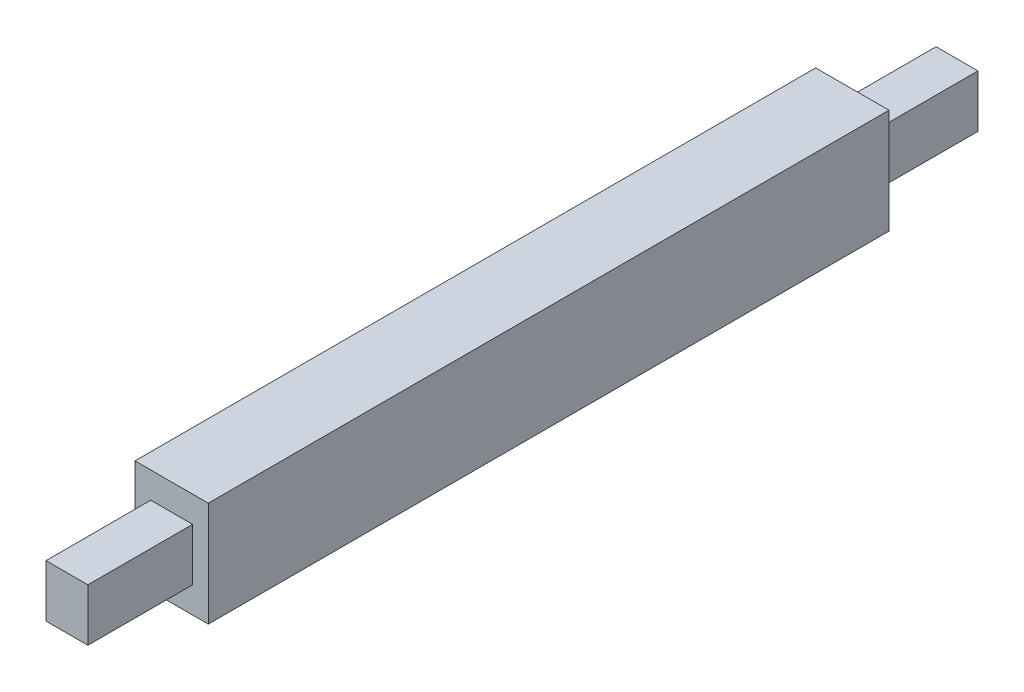
ISO-10303-21;
HEADER;
FILE_DESCRIPTION(('STEP AP214'),'2;1');
FILE_NAME('part.step','',(''),(''),'','','');
FILE_SCHEMA(('AUTOMOTIVE_DESIGN { 1 0 10303 214 1 1 1 1 }'));
ENDSEC;
DATA;
#1=APPLICATION_CONTEXT('core data for automotive mechanical design processes');
#2=APPLICATION_PROTOCOL_DEFINITION('international standard','automotive_design',2000,#1);
#3=PRODUCT_CONTEXT('',#1,'mechanical');
#4=PRODUCT('Part','Part','',(#3));
#5=PRODUCT_RELATED_PRODUCT_CATEGORY('part','',(#4));
#6=PRODUCT_DEFINITION_FORMATION('','',#4);
#7=PRODUCT_DEFINITION_CONTEXT('part definition',#1,'design');
#8=PRODUCT_DEFINITION('design','',#6,#7);
#9=PRODUCT_DEFINITION_SHAPE('','',#8);
#10=(LENGTH_UNIT() NAMED_UNIT(*) SI_UNIT(.MILLI.,.METRE.));
#11=(NAMED_UNIT(*) PLANE_ANGLE_UNIT() SI_UNIT($,.RADIAN.));
#12=(NAMED_UNIT(*) SI_UNIT($,.STERADIAN.) SOLID_ANGLE_UNIT());
#13=UNCERTAINTY_MEASURE_WITH_UNIT(LENGTH_MEASURE(1.E-05),#10,'distance_accuracy_value','');
#14=(GEOMETRIC_REPRESENTATION_CONTEXT(3) GLOBAL_UNCERTAINTY_ASSIGNED_CONTEXT((#13)) GLOBAL_UNIT_ASSIGNED_CONTEXT((#10,
#11,#12)) REPRESENTATION_CONTEXT('',''));
#15=CARTESIAN_POINT('',(0.,0.,0.));
#16=DIRECTION('',(0.,0.,1.));
#17=DIRECTION('',(1.,0.,0.));
#18=AXIS2_PLACEMENT_3D('',#15,#16,#17);
#19=CARTESIAN_POINT('',(0.,0.,-32.5));
#20=DIRECTION('',(0.,0.,1.));
#21=DIRECTION('',(1.,0.,0.));
#22=AXIS2_PLACEMENT_3D('',#19,#20,#21);
#23=PLANE('',#22);
#24=DIRECTION('',(0.,-1.,0.));
#25=VECTOR('',#24,1.);
#26=CARTESIAN_POINT('',(-3.5,-5.,-32.5));
#27=LINE('',#26,#25);
#28=CARTESIAN_POINT('',(-3.5,5.,-32.5));
#29=VERTEX_POINT('',#28);
#30=CARTESIAN_POINT('',(-3.5,-5.,-32.5));
#31=VERTEX_POINT('',#30);
#32=EDGE_CURVE('E203',#29,#31,#27,.T.);
#33=ORIENTED_EDGE('',*,*,#32,.F.);
#34=DIRECTION('',(-1.,0.,0.));
#35=VECTOR('',#34,1.);
#36=CARTESIAN_POINT('',(3.5,5.,-32.5));
#37=LINE('',#36,#35);
#38=CARTESIAN_POINT('',(3.5,5.,-32.5));
#39=VERTEX_POINT('',#38);
#40=EDGE_CURVE('E209',#39,#29,#37,.T.);
#41=ORIENTED_EDGE('',*,*,#40,.F.);
#42=DIRECTION('',(0.,1.,0.));
#43=VECTOR('',#42,1.);
#44=CARTESIAN_POINT('',(3.5,-5.,-32.5));
#45=LINE('',#44,#43);
#46=CARTESIAN_POINT('',(3.5,-5.,-32.5));
#47=VERTEX_POINT('',#46);
#48=EDGE_CURVE('E225',#47,#39,#45,.T.);
#49=ORIENTED_EDGE('',*,*,#48,.F.);
#50=DIRECTION('',(1.,0.,0.));
#51=VECTOR('',#50,1.);
#52=CARTESIAN_POINT('',(3.5,-5.,-32.5));
#53=LINE('',#52,#51);
#54=EDGE_CURVE('E222',#31,#47,#53,.T.);
#55=ORIENTED_EDGE('',*,*,#54,.F.);
#56=EDGE_LOOP('',(#33,#41,#49,#55));
#57=FACE_BOUND('',#56,.T.);
#58=DIRECTION('',(0.,-1.,0.));
#59=VECTOR('',#58,1.);
#60=CARTESIAN_POINT('',(2.,-2.5,-32.5));
#61=LINE('',#60,#59);
#62=CARTESIAN_POINT('',(2.,2.5,-32.5));
#63=VERTEX_POINT('',#62);
#64=CARTESIAN_POINT('',(2.,-2.5,-32.5));
#65=VERTEX_POINT('',#64);
#66=EDGE_CURVE('E55',#63,#65,#61,.T.);
#67=ORIENTED_EDGE('',*,*,#66,.F.);
#68=DIRECTION('',(1.,0.,0.));
#69=VECTOR('',#68,1.);
#70=CARTESIAN_POINT('',(-2.,2.5,-32.5));
#71=LINE('',#70,#69);
#72=CARTESIAN_POINT('',(-2.,2.5,-32.5));
#73=VERTEX_POINT('',#72);
#74=EDGE_CURVE('E59',#73,#63,#71,.T.);
#75=ORIENTED_EDGE('',*,*,#74,.F.);
#76=DIRECTION('',(0.,1.,0.));
#77=VECTOR('',#76,1.);
#78=CARTESIAN_POINT('',(-2.,-2.5,-32.5));
#79=LINE('',#78,#77);
#80=CARTESIAN_POINT('',(-2.,-2.5,-32.5));
#81=VERTEX_POINT('',#80);
#82=EDGE_CURVE('E410',#81,#73,#79,.T.);
#83=ORIENTED_EDGE('',*,*,#82,.F.);
#84=DIRECTION('',(-1.,0.,0.));
#85=VECTOR('',#84,1.);
#86=CARTESIAN_POINT('',(-2.,-2.5,-32.5));
#87=LINE('',#86,#85);
#88=EDGE_CURVE('E420',#65,#81,#87,.T.);
#89=ORIENTED_EDGE('',*,*,#88,.F.);
#90=EDGE_LOOP('',(#67,#75,#83,#89));
#91=FACE_BOUND('',#90,.T.);
#92=ADVANCED_FACE('F39',(#57,#91),#23,.F.);
#93=CARTESIAN_POINT('',(-3.5,-5.,32.5));
#94=DIRECTION('',(1.,0.,0.));
#95=DIRECTION('',(0.,0.,-1.));
#96=AXIS2_PLACEMENT_3D('',#93,#94,#95);
#97=PLANE('',#96);
#98=ORIENTED_EDGE('',*,*,#32,.T.);
#99=DIRECTION('',(0.,0.,-1.));
#100=VECTOR('',#99,1.);
#101=CARTESIAN_POINT('',(-3.5,-5.,32.5));
#102=LINE('',#101,#100);
#103=CARTESIAN_POINT('',(-3.5,-5.,32.5));
#104=VERTEX_POINT('',#103);
#105=EDGE_CURVE('E11',#104,#31,#102,.T.);
#106=ORIENTED_EDGE('',*,*,#105,.F.);
#107=DIRECTION('',(0.,-1.,0.));
#108=VECTOR('',#107,1.);
#109=CARTESIAN_POINT('',(-3.5,-5.,32.5));
#110=LINE('',#109,#108);
#111=CARTESIAN_POINT('',(-3.5,5.,32.5));
#112=VERTEX_POINT('',#111);
#113=EDGE_CURVE('E204',#112,#104,#110,.T.);
#114=ORIENTED_EDGE('',*,*,#113,.F.);
#115=DIRECTION('',(0.,0.,-1.));
#116=VECTOR('',#115,1.);
#117=CARTESIAN_POINT('',(-3.5,5.,32.5));
#118=LINE('',#117,#116);
#119=EDGE_CURVE('E218',#112,#29,#118,.T.);
#120=ORIENTED_EDGE('',*,*,#119,.T.);
#121=EDGE_LOOP('',(#98,#106,#114,#120));
#122=FACE_BOUND('',#121,.T.);
#123=ADVANCED_FACE('F41',(#122),#97,.F.);
#124=CARTESIAN_POINT('',(3.5,-5.,32.5));
#125=DIRECTION('',(0.,1.,0.));
#126=DIRECTION('',(-1.,0.,0.));
#127=AXIS2_PLACEMENT_3D('',#124,#125,#126);
#128=PLANE('',#127);
#129=ORIENTED_EDGE('',*,*,#54,.T.);
#130=DIRECTION('',(0.,0.,-1.));
#131=VECTOR('',#130,1.);
#132=CARTESIAN_POINT('',(3.5,-5.,32.5));
#133=LINE('',#132,#131);
#134=CARTESIAN_POINT('',(3.5,-5.,32.5));
#135=VERTEX_POINT('',#134);
#136=EDGE_CURVE('E48',#135,#47,#133,.T.);
#137=ORIENTED_EDGE('',*,*,#136,.F.);
#138=DIRECTION('',(1.,0.,0.));
#139=VECTOR('',#138,1.);
#140=CARTESIAN_POINT('',(3.5,-5.,32.5));
#141=LINE('',#140,#139);
#142=EDGE_CURVE('E208',#104,#135,#141,.T.);
#143=ORIENTED_EDGE('',*,*,#142,.F.);
#144=ORIENTED_EDGE('',*,*,#105,.T.);
#145=EDGE_LOOP('',(#129,#137,#143,#144));
#146=FACE_BOUND('',#145,.T.);
#147=ADVANCED_FACE('F257',(#146),#128,.F.);
#148=CARTESIAN_POINT('',(3.5,-5.,32.5));
#149=DIRECTION('',(-1.,0.,0.));
#150=DIRECTION('',(0.,-1.,0.));
#151=AXIS2_PLACEMENT_3D('',#148,#149,#150);
#152=PLANE('',#151);
#153=ORIENTED_EDGE('',*,*,#48,.T.);
#154=DIRECTION('',(0.,0.,-1.));
#155=VECTOR('',#154,1.);
#156=CARTESIAN_POINT('',(3.5,5.,32.5));
#157=LINE('',#156,#155);
#158=CARTESIAN_POINT('',(3.5,5.,32.5));
#159=VERTEX_POINT('',#158);
#160=EDGE_CURVE('E233',#159,#39,#157,.T.);
#161=ORIENTED_EDGE('',*,*,#160,.F.);
#162=DIRECTION('',(0.,1.,0.));
#163=VECTOR('',#162,1.);
#164=CARTESIAN_POINT('',(3.5,-5.,32.5));
#165=LINE('',#164,#163);
#166=EDGE_CURVE('E212',#135,#159,#165,.T.);
#167=ORIENTED_EDGE('',*,*,#166,.F.);
#168=ORIENTED_EDGE('',*,*,#136,.T.);
#169=EDGE_LOOP('',(#153,#161,#167,#168));
#170=FACE_BOUND('',#169,.T.);
#171=ADVANCED_FACE('F242',(#170),#152,.F.);
#172=CARTESIAN_POINT('',(3.5,5.,32.5));
#173=DIRECTION('',(0.,-1.,0.));
#174=DIRECTION('',(1.,0.,0.));
#175=AXIS2_PLACEMENT_3D('',#172,#173,#174);
#176=PLANE('',#175);
#177=ORIENTED_EDGE('',*,*,#40,.T.);
#178=ORIENTED_EDGE('',*,*,#119,.F.);
#179=DIRECTION('',(-1.,0.,0.));
#180=VECTOR('',#179,1.);
#181=CARTESIAN_POINT('',(3.5,5.,32.5));
#182=LINE('',#181,#180);
#183=EDGE_CURVE('E215',#159,#112,#182,.T.);
#184=ORIENTED_EDGE('',*,*,#183,.F.);
#185=ORIENTED_EDGE('',*,*,#160,.T.);
#186=EDGE_LOOP('',(#177,#178,#184,#185));
#187=FACE_BOUND('',#186,.T.);
#188=ADVANCED_FACE('F250',(#187),#176,.F.);
#189=CARTESIAN_POINT('',(0.,0.,32.5));
#190=DIRECTION('',(0.,0.,1.));
#191=DIRECTION('',(1.,0.,0.));
#192=AXIS2_PLACEMENT_3D('',#189,#190,#191);
#193=PLANE('',#192);
#194=DIRECTION('',(0.,-1.,0.));
#195=VECTOR('',#194,1.);
#196=CARTESIAN_POINT('',(-2.,-2.5,32.5));
#197=LINE('',#196,#195);
#198=CARTESIAN_POINT('',(-2.,2.5,32.5));
#199=VERTEX_POINT('',#198);
#200=CARTESIAN_POINT('',(-2.,-2.5,32.5));
#201=VERTEX_POINT('',#200);
#202=EDGE_CURVE('E152',#199,#201,#197,.T.);
#203=ORIENTED_EDGE('',*,*,#202,.F.);
#204=DIRECTION('',(-1.,0.,0.));
#205=VECTOR('',#204,1.);
#206=CARTESIAN_POINT('',(2.,2.5,32.5));
#207=LINE('',#206,#205);
#208=CARTESIAN_POINT('',(2.,2.5,32.5));
#209=VERTEX_POINT('',#208);
#210=EDGE_CURVE('E168',#209,#199,#207,.T.);
#211=ORIENTED_EDGE('',*,*,#210,.F.);
#212=DIRECTION('',(0.,1.,0.));
#213=VECTOR('',#212,1.);
#214=CARTESIAN_POINT('',(2.,-2.5,32.5));
#215=LINE('',#214,#213);
#216=CARTESIAN_POINT('',(2.,-2.5,32.5));
#217=VERTEX_POINT('',#216);
#218=EDGE_CURVE('E181',#217,#209,#215,.T.);
#219=ORIENTED_EDGE('',*,*,#218,.F.);
#220=DIRECTION('',(1.,0.,0.));
#221=VECTOR('',#220,1.);
#222=CARTESIAN_POINT('',(2.,-2.5,32.5));
#223=LINE('',#222,#221);
#224=EDGE_CURVE('E157',#201,#217,#223,.T.);
#225=ORIENTED_EDGE('',*,*,#224,.F.);
#226=EDGE_LOOP('',(#203,#211,#219,#225));
#227=FACE_BOUND('',#226,.T.);
#228=ORIENTED_EDGE('',*,*,#113,.T.);
#229=ORIENTED_EDGE('',*,*,#142,.T.);
#230=ORIENTED_EDGE('',*,*,#166,.T.);
#231=ORIENTED_EDGE('',*,*,#183,.T.);
#232=EDGE_LOOP('',(#228,#229,#230,#231));
#233=FACE_BOUND('',#232,.T.);
#234=ADVANCED_FACE('F256',(#227,#233),#193,.T.);
#235=CARTESIAN_POINT('',(-2.,-2.5,42.5));
#236=DIRECTION('',(1.,0.,0.));
#237=DIRECTION('',(0.,0.,-1.));
#238=AXIS2_PLACEMENT_3D('',#235,#236,#237);
#239=PLANE('',#238);
#240=ORIENTED_EDGE('',*,*,#202,.T.);
#241=DIRECTION('',(0.,0.,-1.));
#242=VECTOR('',#241,1.);
#243=CARTESIAN_POINT('',(-2.,-2.5,42.5));
#244=LINE('',#243,#242);
#245=CARTESIAN_POINT('',(-2.,-2.5,42.5));
#246=VERTEX_POINT('',#245);
#247=EDGE_CURVE('E199',#246,#201,#244,.T.);
#248=ORIENTED_EDGE('',*,*,#247,.F.);
#249=DIRECTION('',(0.,-1.,0.));
#250=VECTOR('',#249,1.);
#251=CARTESIAN_POINT('',(-2.,-2.5,42.5));
#252=LINE('',#251,#250);
#253=CARTESIAN_POINT('',(-2.,2.5,42.5));
#254=VERTEX_POINT('',#253);
#255=EDGE_CURVE('E163',#254,#246,#252,.T.);
#256=ORIENTED_EDGE('',*,*,#255,.F.);
#257=DIRECTION('',(0.,0.,-1.));
#258=VECTOR('',#257,1.);
#259=CARTESIAN_POINT('',(-2.,2.5,42.5));
#260=LINE('',#259,#258);
#261=EDGE_CURVE('E176',#254,#199,#260,.T.);
#262=ORIENTED_EDGE('',*,*,#261,.T.);
#263=EDGE_LOOP('',(#240,#248,#256,#262));
#264=FACE_BOUND('',#263,.T.);
#265=ADVANCED_FACE('F275',(#264),#239,.F.);
#266=CARTESIAN_POINT('',(2.,-2.5,42.5));
#267=DIRECTION('',(0.,1.,0.));
#268=DIRECTION('',(-1.,0.,0.));
#269=AXIS2_PLACEMENT_3D('',#266,#267,#268);
#270=PLANE('',#269);
#271=ORIENTED_EDGE('',*,*,#224,.T.);
#272=DIRECTION('',(0.,0.,-1.));
#273=VECTOR('',#272,1.);
#274=CARTESIAN_POINT('',(2.,-2.5,42.5));
#275=LINE('',#274,#273);
#276=CARTESIAN_POINT('',(2.,-2.5,42.5));
#277=VERTEX_POINT('',#276);
#278=EDGE_CURVE('E195',#277,#217,#275,.T.);
#279=ORIENTED_EDGE('',*,*,#278,.F.);
#280=DIRECTION('',(1.,0.,0.));
#281=VECTOR('',#280,1.);
#282=CARTESIAN_POINT('',(2.,-2.5,42.5));
#283=LINE('',#282,#281);
#284=EDGE_CURVE('E167',#246,#277,#283,.T.);
#285=ORIENTED_EDGE('',*,*,#284,.F.);
#286=ORIENTED_EDGE('',*,*,#247,.T.);
#287=EDGE_LOOP('',(#271,#279,#285,#286));
#288=FACE_BOUND('',#287,.T.);
#289=ADVANCED_FACE('F280',(#288),#270,.F.);
#290=CARTESIAN_POINT('',(2.,-2.5,42.5));
#291=DIRECTION('',(-1.,0.,0.));
#292=DIRECTION('',(0.,-1.,0.));
#293=AXIS2_PLACEMENT_3D('',#290,#291,#292);
#294=PLANE('',#293);
#295=ORIENTED_EDGE('',*,*,#218,.T.);
#296=DIRECTION('',(0.,0.,-1.));
#297=VECTOR('',#296,1.);
#298=CARTESIAN_POINT('',(2.,2.5,42.5));
#299=LINE('',#298,#297);
#300=CARTESIAN_POINT('',(2.,2.5,42.5));
#301=VERTEX_POINT('',#300);
#302=EDGE_CURVE('E191',#301,#209,#299,.T.);
#303=ORIENTED_EDGE('',*,*,#302,.F.);
#304=DIRECTION('',(0.,1.,0.));
#305=VECTOR('',#304,1.);
#306=CARTESIAN_POINT('',(2.,-2.5,42.5));
#307=LINE('',#306,#305);
#308=EDGE_CURVE('E171',#277,#301,#307,.T.);
#309=ORIENTED_EDGE('',*,*,#308,.F.);
#310=ORIENTED_EDGE('',*,*,#278,.T.);
#311=EDGE_LOOP('',(#295,#303,#309,#310));
#312=FACE_BOUND('',#311,.T.);
#313=ADVANCED_FACE('F294',(#312),#294,.F.);
#314=CARTESIAN_POINT('',(2.,2.5,42.5));
#315=DIRECTION('',(0.,-1.,0.));
#316=DIRECTION('',(1.,0.,0.));
#317=AXIS2_PLACEMENT_3D('',#314,#315,#316);
#318=PLANE('',#317);
#319=ORIENTED_EDGE('',*,*,#210,.T.);
#320=ORIENTED_EDGE('',*,*,#261,.F.);
#321=DIRECTION('',(-1.,0.,0.));
#322=VECTOR('',#321,1.);
#323=CARTESIAN_POINT('',(2.,2.5,42.5));
#324=LINE('',#323,#322);
#325=EDGE_CURVE('E174',#301,#254,#324,.T.);
#326=ORIENTED_EDGE('',*,*,#325,.F.);
#327=ORIENTED_EDGE('',*,*,#302,.T.);
#328=EDGE_LOOP('',(#319,#320,#326,#327));
#329=FACE_BOUND('',#328,.T.);
#330=ADVANCED_FACE('F285',(#329),#318,.F.);
#331=CARTESIAN_POINT('',(0.,0.,42.5));
#332=DIRECTION('',(0.,0.,1.));
#333=DIRECTION('',(1.,0.,0.));
#334=AXIS2_PLACEMENT_3D('',#331,#332,#333);
#335=PLANE('',#334);
#336=ORIENTED_EDGE('',*,*,#255,.T.);
#337=ORIENTED_EDGE('',*,*,#284,.T.);
#338=ORIENTED_EDGE('',*,*,#308,.T.);
#339=ORIENTED_EDGE('',*,*,#325,.T.);
#340=EDGE_LOOP('',(#336,#337,#338,#339));
#341=FACE_BOUND('',#340,.T.);
#342=ADVANCED_FACE('F290',(#341),#335,.T.);
#343=CARTESIAN_POINT('',(2.,-2.5,-42.5));
#344=DIRECTION('',(-1.,0.,0.));
#345=DIRECTION('',(0.,0.,1.));
#346=AXIS2_PLACEMENT_3D('',#343,#344,#345);
#347=PLANE('',#346);
#348=ORIENTED_EDGE('',*,*,#66,.T.);
#349=DIRECTION('',(0.,0.,1.));
#350=VECTOR('',#349,1.);
#351=CARTESIAN_POINT('',(2.,-2.5,-42.5));
#352=LINE('',#351,#350);
#353=CARTESIAN_POINT('',(2.,-2.5,-42.5));
#354=VERTEX_POINT('',#353);
#355=EDGE_CURVE('E132',#354,#65,#352,.T.);
#356=ORIENTED_EDGE('',*,*,#355,.F.);
#357=DIRECTION('',(0.,-1.,0.));
#358=VECTOR('',#357,1.);
#359=CARTESIAN_POINT('',(2.,-2.5,-42.5));
#360=LINE('',#359,#358);
#361=CARTESIAN_POINT('',(2.,2.5,-42.5));
#362=VERTEX_POINT('',#361);
#363=EDGE_CURVE('E139',#362,#354,#360,.T.);
#364=ORIENTED_EDGE('',*,*,#363,.F.);
#365=DIRECTION('',(0.,0.,1.));
#366=VECTOR('',#365,1.);
#367=CARTESIAN_POINT('',(2.,2.5,-42.5));
#368=LINE('',#367,#366);
#369=EDGE_CURVE('E407',#362,#63,#368,.T.);
#370=ORIENTED_EDGE('',*,*,#369,.T.);
#371=EDGE_LOOP('',(#348,#356,#364,#370));
#372=FACE_BOUND('',#371,.T.);
#373=ADVANCED_FACE('F150',(#372),#347,.F.);
#374=CARTESIAN_POINT('',(-2.,-2.5,-42.5));
#375=DIRECTION('',(0.,1.,0.));
#376=DIRECTION('',(-1.,0.,0.));
#377=AXIS2_PLACEMENT_3D('',#374,#375,#376);
#378=PLANE('',#377);
#379=ORIENTED_EDGE('',*,*,#88,.T.);
#380=DIRECTION('',(0.,0.,1.));
#381=VECTOR('',#380,1.);
#382=CARTESIAN_POINT('',(-2.,-2.5,-42.5));
#383=LINE('',#382,#381);
#384=CARTESIAN_POINT('',(-2.,-2.5,-42.5));
#385=VERTEX_POINT('',#384);
#386=EDGE_CURVE('E134',#385,#81,#383,.T.);
#387=ORIENTED_EDGE('',*,*,#386,.F.);
#388=DIRECTION('',(-1.,0.,0.));
#389=VECTOR('',#388,1.);
#390=CARTESIAN_POINT('',(-2.,-2.5,-42.5));
#391=LINE('',#390,#389);
#392=EDGE_CURVE('E127',#354,#385,#391,.T.);
#393=ORIENTED_EDGE('',*,*,#392,.F.);
#394=ORIENTED_EDGE('',*,*,#355,.T.);
#395=EDGE_LOOP('',(#379,#387,#393,#394));
#396=FACE_BOUND('',#395,.T.);
#397=ADVANCED_FACE('F130',(#396),#378,.F.);
#398=CARTESIAN_POINT('',(-2.,-2.5,-42.5));
#399=DIRECTION('',(1.,0.,0.));
#400=DIRECTION('',(0.,0.,-1.));
#401=AXIS2_PLACEMENT_3D('',#398,#399,#400);
#402=PLANE('',#401);
#403=ORIENTED_EDGE('',*,*,#82,.T.);
#404=DIRECTION('',(0.,0.,1.));
#405=VECTOR('',#404,1.);
#406=CARTESIAN_POINT('',(-2.,2.5,-42.5));
#407=LINE('',#406,#405);
#408=CARTESIAN_POINT('',(-2.,2.5,-42.5));
#409=VERTEX_POINT('',#408);
#410=EDGE_CURVE('E159',#409,#73,#407,.T.);
#411=ORIENTED_EDGE('',*,*,#410,.F.);
#412=DIRECTION('',(0.,1.,0.));
#413=VECTOR('',#412,1.);
#414=CARTESIAN_POINT('',(-2.,-2.5,-42.5));
#415=LINE('',#414,#413);
#416=EDGE_CURVE('E138',#385,#409,#415,.T.);
#417=ORIENTED_EDGE('',*,*,#416,.F.);
#418=ORIENTED_EDGE('',*,*,#386,.T.);
#419=EDGE_LOOP('',(#403,#411,#417,#418));
#420=FACE_BOUND('',#419,.T.);
#421=ADVANCED_FACE('F311',(#420),#402,.F.);
#422=CARTESIAN_POINT('',(-2.,2.5,-42.5));
#423=DIRECTION('',(0.,-1.,0.));
#424=DIRECTION('',(1.,0.,0.));
#425=AXIS2_PLACEMENT_3D('',#422,#423,#424);
#426=PLANE('',#425);
#427=ORIENTED_EDGE('',*,*,#74,.T.);
#428=ORIENTED_EDGE('',*,*,#369,.F.);
#429=DIRECTION('',(1.,0.,0.));
#430=VECTOR('',#429,1.);
#431=CARTESIAN_POINT('',(-2.,2.5,-42.5));
#432=LINE('',#431,#430);
#433=EDGE_CURVE('E144',#409,#362,#432,.T.);
#434=ORIENTED_EDGE('',*,*,#433,.F.);
#435=ORIENTED_EDGE('',*,*,#410,.T.);
#436=EDGE_LOOP('',(#427,#428,#434,#435));
#437=FACE_BOUND('',#436,.T.);
#438=ADVANCED_FACE('F314',(#437),#426,.F.);
#439=CARTESIAN_POINT('',(0.,0.,-42.5));
#440=DIRECTION('',(0.,0.,-1.));
#441=DIRECTION('',(-1.,0.,0.));
#442=AXIS2_PLACEMENT_3D('',#439,#440,#441);
#443=PLANE('',#442);
#444=ORIENTED_EDGE('',*,*,#363,.T.);
#445=ORIENTED_EDGE('',*,*,#392,.T.);
#446=ORIENTED_EDGE('',*,*,#416,.T.);
#447=ORIENTED_EDGE('',*,*,#433,.T.);
#448=EDGE_LOOP('',(#444,#445,#446,#447));
#449=FACE_BOUND('',#448,.T.);
#450=ADVANCED_FACE('F142',(#449),#443,.T.);
#451=CLOSED_SHELL('',(#92,#123,#147,#171,#188,#234,#265,#289,#313,#330,#342,#373,#397,#421,#438,#450));
#452=MANIFOLD_SOLID_BREP('B2',#451);
#453=ADVANCED_BREP_SHAPE_REPRESENTATION('',(#18,#452),#14);
#454=SHAPE_DEFINITION_REPRESENTATION(#9,#453);
ENDSEC;
END-ISO-10303-21;
